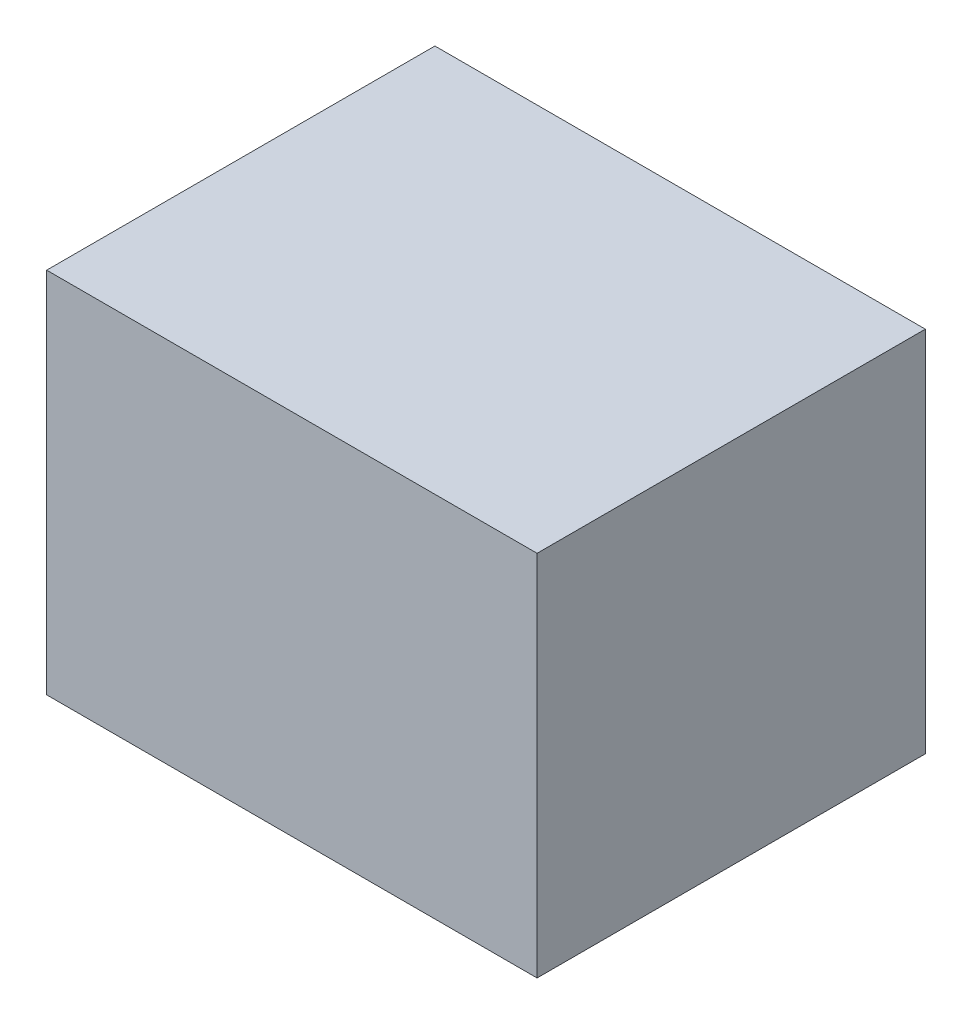
ISO-10303-21;
HEADER;
FILE_DESCRIPTION(('STEP AP214'),'2;1');
FILE_NAME('part.step','',(''),(''),'','','');
FILE_SCHEMA(('AUTOMOTIVE_DESIGN { 1 0 10303 214 1 1 1 1 }'));
ENDSEC;
DATA;
#1=APPLICATION_CONTEXT('core data for automotive mechanical design processes');
#2=APPLICATION_PROTOCOL_DEFINITION('international standard','automotive_design',2000,#1);
#3=PRODUCT_CONTEXT('',#1,'mechanical');
#4=PRODUCT('Part','Part','',(#3));
#5=PRODUCT_RELATED_PRODUCT_CATEGORY('part','',(#4));
#6=PRODUCT_DEFINITION_FORMATION('','',#4);
#7=PRODUCT_DEFINITION_CONTEXT('part definition',#1,'design');
#8=PRODUCT_DEFINITION('design','',#6,#7);
#9=PRODUCT_DEFINITION_SHAPE('','',#8);
#10=(LENGTH_UNIT() NAMED_UNIT(*) SI_UNIT(.MILLI.,.METRE.));
#11=(NAMED_UNIT(*) PLANE_ANGLE_UNIT() SI_UNIT($,.RADIAN.));
#12=(NAMED_UNIT(*) SI_UNIT($,.STERADIAN.) SOLID_ANGLE_UNIT());
#13=UNCERTAINTY_MEASURE_WITH_UNIT(LENGTH_MEASURE(1.E-05),#10,'distance_accuracy_value','');
#14=(GEOMETRIC_REPRESENTATION_CONTEXT(3) GLOBAL_UNCERTAINTY_ASSIGNED_CONTEXT((#13)) GLOBAL_UNIT_ASSIGNED_CONTEXT((#10,
#11,#12)) REPRESENTATION_CONTEXT('',''));
#15=CARTESIAN_POINT('',(0.,0.,0.));
#16=DIRECTION('',(0.,0.,1.));
#17=DIRECTION('',(1.,0.,0.));
#18=AXIS2_PLACEMENT_3D('',#15,#16,#17);
#19=CARTESIAN_POINT('',(-1.20000014,0.90000074,0.));
#20=DIRECTION('',(1.,0.,0.));
#21=DIRECTION('',(0.,-1.,0.));
#22=AXIS2_PLACEMENT_3D('',#19,#20,#21);
#23=PLANE('',#22);
#24=DIRECTION('',(0.,-1.,0.));
#25=VECTOR('',#24,1.);
#26=CARTESIAN_POINT('',(-1.20000014,0.90000074,0.));
#27=LINE('',#26,#25);
#28=CARTESIAN_POINT('',(-1.20000014,0.90000074,0.));
#29=VERTEX_POINT('',#28);
#30=CARTESIAN_POINT('',(-1.20000014,-0.8999982,0.));
#31=VERTEX_POINT('',#30);
#32=EDGE_CURVE('E11',#29,#31,#27,.T.);
#33=ORIENTED_EDGE('',*,*,#32,.T.);
#34=DIRECTION('',(0.,0.,1.));
#35=VECTOR('',#34,1.);
#36=CARTESIAN_POINT('',(-1.20000014,-0.8999982,0.));
#37=LINE('',#36,#35);
#38=CARTESIAN_POINT('',(-1.20000014,-0.8999982,1.89999874));
#39=VERTEX_POINT('',#38);
#40=EDGE_CURVE('E23',#31,#39,#37,.T.);
#41=ORIENTED_EDGE('',*,*,#40,.T.);
#42=DIRECTION('',(0.,-1.,0.));
#43=VECTOR('',#42,1.);
#44=CARTESIAN_POINT('',(-1.20000014,0.90000074,1.89999874));
#45=LINE('',#44,#43);
#46=CARTESIAN_POINT('',(-1.20000014,0.90000074,1.89999874));
#47=VERTEX_POINT('',#46);
#48=EDGE_CURVE('E86',#47,#39,#45,.T.);
#49=ORIENTED_EDGE('',*,*,#48,.F.);
#50=DIRECTION('',(0.,0.,1.));
#51=VECTOR('',#50,1.);
#52=CARTESIAN_POINT('',(-1.20000014,0.90000074,0.));
#53=LINE('',#52,#51);
#54=EDGE_CURVE('E35',#29,#47,#53,.T.);
#55=ORIENTED_EDGE('',*,*,#54,.F.);
#56=EDGE_LOOP('',(#33,#41,#49,#55));
#57=FACE_BOUND('',#56,.T.);
#58=ADVANCED_FACE('F16',(#57),#23,.F.);
#59=CARTESIAN_POINT('',(-1.20000014,-0.8999982,0.));
#60=DIRECTION('',(0.,1.,0.));
#61=DIRECTION('',(1.,0.,0.));
#62=AXIS2_PLACEMENT_3D('',#59,#60,#61);
#63=PLANE('',#62);
#64=DIRECTION('',(1.,0.,0.));
#65=VECTOR('',#64,1.);
#66=CARTESIAN_POINT('',(-1.20000014,-0.8999982,0.));
#67=LINE('',#66,#65);
#68=CARTESIAN_POINT('',(1.20000014,-0.8999982,0.));
#69=VERTEX_POINT('',#68);
#70=EDGE_CURVE('E83',#31,#69,#67,.T.);
#71=ORIENTED_EDGE('',*,*,#70,.T.);
#72=DIRECTION('',(0.,0.,1.));
#73=VECTOR('',#72,1.);
#74=CARTESIAN_POINT('',(1.20000014,-0.8999982,0.));
#75=LINE('',#74,#73);
#76=CARTESIAN_POINT('',(1.20000014,-0.8999982,1.89999874));
#77=VERTEX_POINT('',#76);
#78=EDGE_CURVE('E81',#69,#77,#75,.T.);
#79=ORIENTED_EDGE('',*,*,#78,.T.);
#80=DIRECTION('',(1.,0.,0.));
#81=VECTOR('',#80,1.);
#82=CARTESIAN_POINT('',(-1.20000014,-0.8999982,1.89999874));
#83=LINE('',#82,#81);
#84=EDGE_CURVE('E61',#39,#77,#83,.T.);
#85=ORIENTED_EDGE('',*,*,#84,.F.);
#86=ORIENTED_EDGE('',*,*,#40,.F.);
#87=EDGE_LOOP('',(#71,#79,#85,#86));
#88=FACE_BOUND('',#87,.T.);
#89=ADVANCED_FACE('F88',(#88),#63,.F.);
#90=CARTESIAN_POINT('',(1.20000014,-0.8999982,0.));
#91=DIRECTION('',(-1.,0.,0.));
#92=DIRECTION('',(0.,1.,0.));
#93=AXIS2_PLACEMENT_3D('',#90,#91,#92);
#94=PLANE('',#93);
#95=DIRECTION('',(0.,1.,0.));
#96=VECTOR('',#95,1.);
#97=CARTESIAN_POINT('',(1.20000014,-0.8999982,0.));
#98=LINE('',#97,#96);
#99=CARTESIAN_POINT('',(1.20000014,0.90000074,0.));
#100=VERTEX_POINT('',#99);
#101=EDGE_CURVE('E70',#69,#100,#98,.T.);
#102=ORIENTED_EDGE('',*,*,#101,.T.);
#103=DIRECTION('',(0.,0.,1.));
#104=VECTOR('',#103,1.);
#105=CARTESIAN_POINT('',(1.20000014,0.90000074,0.));
#106=LINE('',#105,#104);
#107=CARTESIAN_POINT('',(1.20000014,0.90000074,1.89999874));
#108=VERTEX_POINT('',#107);
#109=EDGE_CURVE('E64',#100,#108,#106,.T.);
#110=ORIENTED_EDGE('',*,*,#109,.T.);
#111=DIRECTION('',(0.,1.,0.));
#112=VECTOR('',#111,1.);
#113=CARTESIAN_POINT('',(1.20000014,-0.8999982,1.89999874));
#114=LINE('',#113,#112);
#115=EDGE_CURVE('E56',#77,#108,#114,.T.);
#116=ORIENTED_EDGE('',*,*,#115,.F.);
#117=ORIENTED_EDGE('',*,*,#78,.F.);
#118=EDGE_LOOP('',(#102,#110,#116,#117));
#119=FACE_BOUND('',#118,.T.);
#120=ADVANCED_FACE('F68',(#119),#94,.F.);
#121=CARTESIAN_POINT('',(1.20000014,0.90000074,0.));
#122=DIRECTION('',(0.,-1.,0.));
#123=DIRECTION('',(-1.,0.,0.));
#124=AXIS2_PLACEMENT_3D('',#121,#122,#123);
#125=PLANE('',#124);
#126=DIRECTION('',(-1.,0.,0.));
#127=VECTOR('',#126,1.);
#128=CARTESIAN_POINT('',(1.20000014,0.90000074,0.));
#129=LINE('',#128,#127);
#130=EDGE_CURVE('E65',#100,#29,#129,.T.);
#131=ORIENTED_EDGE('',*,*,#130,.T.);
#132=ORIENTED_EDGE('',*,*,#54,.T.);
#133=DIRECTION('',(-1.,0.,0.));
#134=VECTOR('',#133,1.);
#135=CARTESIAN_POINT('',(1.20000014,0.90000074,1.89999874));
#136=LINE('',#135,#134);
#137=EDGE_CURVE('E60',#108,#47,#136,.T.);
#138=ORIENTED_EDGE('',*,*,#137,.F.);
#139=ORIENTED_EDGE('',*,*,#109,.F.);
#140=EDGE_LOOP('',(#131,#132,#138,#139));
#141=FACE_BOUND('',#140,.T.);
#142=ADVANCED_FACE('F75',(#141),#125,.F.);
#143=CARTESIAN_POINT('',(-1.20000014,0.90000074,0.));
#144=DIRECTION('',(0.,0.,-1.));
#145=DIRECTION('',(-1.,0.,0.));
#146=AXIS2_PLACEMENT_3D('',#143,#144,#145);
#147=PLANE('',#146);
#148=ORIENTED_EDGE('',*,*,#130,.F.);
#149=ORIENTED_EDGE('',*,*,#101,.F.);
#150=ORIENTED_EDGE('',*,*,#70,.F.);
#151=ORIENTED_EDGE('',*,*,#32,.F.);
#152=EDGE_LOOP('',(#148,#149,#150,#151));
#153=FACE_BOUND('',#152,.T.);
#154=ADVANCED_FACE('F90',(#153),#147,.T.);
#155=CARTESIAN_POINT('',(-1.20000014,0.90000074,1.89999874));
#156=DIRECTION('',(0.,0.,-1.));
#157=DIRECTION('',(-1.,0.,0.));
#158=AXIS2_PLACEMENT_3D('',#155,#156,#157);
#159=PLANE('',#158);
#160=ORIENTED_EDGE('',*,*,#48,.T.);
#161=ORIENTED_EDGE('',*,*,#84,.T.);
#162=ORIENTED_EDGE('',*,*,#115,.T.);
#163=ORIENTED_EDGE('',*,*,#137,.T.);
#164=EDGE_LOOP('',(#160,#161,#162,#163));
#165=FACE_BOUND('',#164,.T.);
#166=ADVANCED_FACE('F58',(#165),#159,.F.);
#167=CLOSED_SHELL('',(#58,#89,#120,#142,#154,#166));
#168=MANIFOLD_SOLID_BREP('B1',#167);
#169=ADVANCED_BREP_SHAPE_REPRESENTATION('',(#18,#168),#14);
#170=SHAPE_DEFINITION_REPRESENTATION(#9,#169);
ENDSEC;
END-ISO-10303-21;
